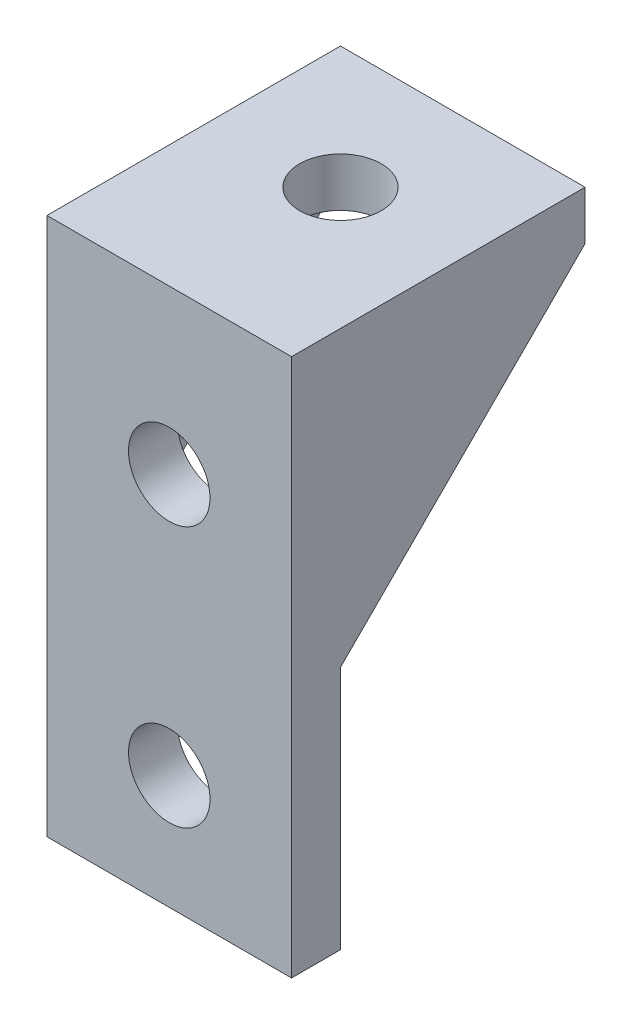
ISO-10303-21;
HEADER;
FILE_DESCRIPTION(('STEP AP214'),'2;1');
FILE_NAME('part.step','',(''),(''),'','','');
FILE_SCHEMA(('AUTOMOTIVE_DESIGN { 1 0 10303 214 1 1 1 1 }'));
ENDSEC;
DATA;
#1=APPLICATION_CONTEXT('core data for automotive mechanical design processes');
#2=APPLICATION_PROTOCOL_DEFINITION('international standard','automotive_design',2000,#1);
#3=PRODUCT_CONTEXT('',#1,'mechanical');
#4=PRODUCT('Part','Part','',(#3));
#5=PRODUCT_RELATED_PRODUCT_CATEGORY('part','',(#4));
#6=PRODUCT_DEFINITION_FORMATION('','',#4);
#7=PRODUCT_DEFINITION_CONTEXT('part definition',#1,'design');
#8=PRODUCT_DEFINITION('design','',#6,#7);
#9=PRODUCT_DEFINITION_SHAPE('','',#8);
#10=(LENGTH_UNIT() NAMED_UNIT(*) SI_UNIT(.MILLI.,.METRE.));
#11=(NAMED_UNIT(*) PLANE_ANGLE_UNIT() SI_UNIT($,.RADIAN.));
#12=(NAMED_UNIT(*) SI_UNIT($,.STERADIAN.) SOLID_ANGLE_UNIT());
#13=UNCERTAINTY_MEASURE_WITH_UNIT(LENGTH_MEASURE(1.E-05),#10,'distance_accuracy_value','');
#14=(GEOMETRIC_REPRESENTATION_CONTEXT(3) GLOBAL_UNCERTAINTY_ASSIGNED_CONTEXT((#13)) GLOBAL_UNIT_ASSIGNED_CONTEXT((#10,
#11,#12)) REPRESENTATION_CONTEXT('',''));
#15=CARTESIAN_POINT('',(0.,0.,0.));
#16=DIRECTION('',(0.,0.,1.));
#17=DIRECTION('',(1.,0.,0.));
#18=AXIS2_PLACEMENT_3D('',#15,#16,#17);
#19=CARTESIAN_POINT('',(0.,15.,0.));
#20=DIRECTION('',(0.,-1.,0.));
#21=DIRECTION('',(0.,0.,-1.));
#22=AXIS2_PLACEMENT_3D('',#19,#20,#21);
#23=PLANE('',#22);
#24=CARTESIAN_POINT('',(0.,15.,-7.5));
#25=DIRECTION('',(0.,1.,0.));
#26=DIRECTION('',(0.,0.,1.));
#27=AXIS2_PLACEMENT_3D('',#24,#25,#26);
#28=CIRCLE('',#27,2.5);
#29=CARTESIAN_POINT('',(0.,15.,-5.));
#30=VERTEX_POINT('',#29);
#31=EDGE_CURVE('E197',#30,#30,#28,.T.);
#32=ORIENTED_EDGE('',*,*,#31,.T.);
#33=EDGE_LOOP('',(#32));
#34=FACE_BOUND('',#33,.T.);
#35=DIRECTION('',(-1.,0.,0.));
#36=VECTOR('',#35,1.);
#37=CARTESIAN_POINT('',(-7.5,15.,0.));
#38=LINE('',#37,#36);
#39=CARTESIAN_POINT('',(5.5,15.,0.));
#40=VERTEX_POINT('',#39);
#41=CARTESIAN_POINT('',(-5.5,15.,0.));
#42=VERTEX_POINT('',#41);
#43=EDGE_CURVE('E94',#40,#42,#38,.T.);
#44=ORIENTED_EDGE('',*,*,#43,.T.);
#45=DIRECTION('',(0.,0.,1.));
#46=VECTOR('',#45,1.);
#47=CARTESIAN_POINT('',(-5.5,15.,-15.));
#48=LINE('',#47,#46);
#49=CARTESIAN_POINT('',(-5.5,15.,-15.));
#50=VERTEX_POINT('',#49);
#51=EDGE_CURVE('E151',#50,#42,#48,.T.);
#52=ORIENTED_EDGE('',*,*,#51,.F.);
#53=DIRECTION('',(-1.,0.,0.));
#54=VECTOR('',#53,1.);
#55=CARTESIAN_POINT('',(-7.5,15.,-15.));
#56=LINE('',#55,#54);
#57=CARTESIAN_POINT('',(5.5,15.,-15.));
#58=VERTEX_POINT('',#57);
#59=EDGE_CURVE('E162',#58,#50,#56,.T.);
#60=ORIENTED_EDGE('',*,*,#59,.F.);
#61=DIRECTION('',(0.,0.,1.));
#62=VECTOR('',#61,1.);
#63=CARTESIAN_POINT('',(5.5,15.,-15.));
#64=LINE('',#63,#62);
#65=EDGE_CURVE('E203',#58,#40,#64,.T.);
#66=ORIENTED_EDGE('',*,*,#65,.T.);
#67=EDGE_LOOP('',(#44,#52,#60,#66));
#68=FACE_BOUND('',#67,.T.);
#69=ADVANCED_FACE('F37',(#34,#68),#23,.T.);
#70=CARTESIAN_POINT('',(0.,0.,0.));
#71=DIRECTION('',(0.,0.,-1.));
#72=DIRECTION('',(-1.,0.,0.));
#73=AXIS2_PLACEMENT_3D('',#70,#71,#72);
#74=PLANE('',#73);
#75=CARTESIAN_POINT('',(0.,8.,0.));
#76=DIRECTION('',(0.,0.,1.));
#77=DIRECTION('',(1.,0.,0.));
#78=AXIS2_PLACEMENT_3D('',#75,#76,#77);
#79=CIRCLE('',#78,2.5);
#80=CARTESIAN_POINT('',(2.5,8.,0.));
#81=VERTEX_POINT('',#80);
#82=EDGE_CURVE('E100',#81,#81,#79,.T.);
#83=ORIENTED_EDGE('',*,*,#82,.T.);
#84=EDGE_LOOP('',(#83));
#85=FACE_BOUND('',#84,.T.);
#86=CARTESIAN_POINT('',(0.,-8.,0.));
#87=DIRECTION('',(0.,0.,1.));
#88=DIRECTION('',(1.,0.,0.));
#89=AXIS2_PLACEMENT_3D('',#86,#87,#88);
#90=CIRCLE('',#89,2.5);
#91=CARTESIAN_POINT('',(2.5,-8.,0.));
#92=VERTEX_POINT('',#91);
#93=EDGE_CURVE('E171',#92,#92,#90,.T.);
#94=ORIENTED_EDGE('',*,*,#93,.T.);
#95=EDGE_LOOP('',(#94));
#96=FACE_BOUND('',#95,.T.);
#97=DIRECTION('',(0.,-1.,0.));
#98=VECTOR('',#97,1.);
#99=CARTESIAN_POINT('',(-7.5,-15.,0.));
#100=LINE('',#99,#98);
#101=CARTESIAN_POINT('',(-7.5,1.57859836313889E-13,0.));
#102=VERTEX_POINT('',#101);
#103=CARTESIAN_POINT('',(-7.5,-15.,0.));
#104=VERTEX_POINT('',#103);
#105=EDGE_CURVE('E82',#102,#104,#100,.T.);
#106=ORIENTED_EDGE('',*,*,#105,.F.);
#107=DIRECTION('',(-1.,0.,0.));
#108=VECTOR('',#107,1.);
#109=CARTESIAN_POINT('',(-5.5,1.57859836313889E-13,0.));
#110=LINE('',#109,#108);
#111=CARTESIAN_POINT('',(-5.5,1.57859836313889E-13,0.));
#112=VERTEX_POINT('',#111);
#113=EDGE_CURVE('E117',#112,#102,#110,.T.);
#114=ORIENTED_EDGE('',*,*,#113,.F.);
#115=DIRECTION('',(0.,-1.,0.));
#116=VECTOR('',#115,1.);
#117=CARTESIAN_POINT('',(-5.5,15.,0.));
#118=LINE('',#117,#116);
#119=EDGE_CURVE('E163',#42,#112,#118,.T.);
#120=ORIENTED_EDGE('',*,*,#119,.F.);
#121=ORIENTED_EDGE('',*,*,#43,.F.);
#122=DIRECTION('',(0.,-1.,0.));
#123=VECTOR('',#122,1.);
#124=CARTESIAN_POINT('',(5.5,15.,0.));
#125=LINE('',#124,#123);
#126=CARTESIAN_POINT('',(5.5,1.57859836313889E-13,0.));
#127=VERTEX_POINT('',#126);
#128=EDGE_CURVE('E206',#40,#127,#125,.T.);
#129=ORIENTED_EDGE('',*,*,#128,.T.);
#130=DIRECTION('',(1.,0.,0.));
#131=VECTOR('',#130,1.);
#132=CARTESIAN_POINT('',(5.5,1.57859836313889E-13,0.));
#133=LINE('',#132,#131);
#134=CARTESIAN_POINT('',(7.5,1.57859836313889E-13,0.));
#135=VERTEX_POINT('',#134);
#136=EDGE_CURVE('E93',#127,#135,#133,.T.);
#137=ORIENTED_EDGE('',*,*,#136,.T.);
#138=DIRECTION('',(0.,1.,0.));
#139=VECTOR('',#138,1.);
#140=CARTESIAN_POINT('',(7.5,-15.,0.));
#141=LINE('',#140,#139);
#142=CARTESIAN_POINT('',(7.5,-15.,0.));
#143=VERTEX_POINT('',#142);
#144=EDGE_CURVE('E88',#143,#135,#141,.T.);
#145=ORIENTED_EDGE('',*,*,#144,.F.);
#146=DIRECTION('',(1.,0.,0.));
#147=VECTOR('',#146,1.);
#148=CARTESIAN_POINT('',(-7.5,-15.,0.));
#149=LINE('',#148,#147);
#150=EDGE_CURVE('E73',#104,#143,#149,.T.);
#151=ORIENTED_EDGE('',*,*,#150,.F.);
#152=EDGE_LOOP('',(#106,#114,#120,#121,#129,#137,#145,#151));
#153=FACE_BOUND('',#152,.T.);
#154=ADVANCED_FACE('F91',(#85,#96,#153),#74,.T.);
#155=CARTESIAN_POINT('',(0.,0.,3.));
#156=DIRECTION('',(0.,0.,-1.));
#157=DIRECTION('',(-1.,0.,0.));
#158=AXIS2_PLACEMENT_3D('',#155,#156,#157);
#159=PLANE('',#158);
#160=DIRECTION('',(0.,1.,0.));
#161=VECTOR('',#160,1.);
#162=CARTESIAN_POINT('',(7.5,-15.,3.));
#163=LINE('',#162,#161);
#164=CARTESIAN_POINT('',(7.5,-15.,3.));
#165=VERTEX_POINT('',#164);
#166=CARTESIAN_POINT('',(7.5,18.,3.));
#167=VERTEX_POINT('',#166);
#168=EDGE_CURVE('E81',#165,#167,#163,.T.);
#169=ORIENTED_EDGE('',*,*,#168,.T.);
#170=DIRECTION('',(1.,0.,0.));
#171=VECTOR('',#170,1.);
#172=CARTESIAN_POINT('',(-7.5,18.,3.));
#173=LINE('',#172,#171);
#174=CARTESIAN_POINT('',(-7.5,18.,3.));
#175=VERTEX_POINT('',#174);
#176=EDGE_CURVE('E190',#175,#167,#173,.T.);
#177=ORIENTED_EDGE('',*,*,#176,.F.);
#178=DIRECTION('',(0.,-1.,0.));
#179=VECTOR('',#178,1.);
#180=CARTESIAN_POINT('',(-7.5,-15.,3.));
#181=LINE('',#180,#179);
#182=CARTESIAN_POINT('',(-7.5,-15.,3.));
#183=VERTEX_POINT('',#182);
#184=EDGE_CURVE('E185',#175,#183,#181,.T.);
#185=ORIENTED_EDGE('',*,*,#184,.T.);
#186=DIRECTION('',(1.,0.,0.));
#187=VECTOR('',#186,1.);
#188=CARTESIAN_POINT('',(-7.5,-15.,3.));
#189=LINE('',#188,#187);
#190=EDGE_CURVE('E61',#183,#165,#189,.T.);
#191=ORIENTED_EDGE('',*,*,#190,.T.);
#192=EDGE_LOOP('',(#169,#177,#185,#191));
#193=FACE_BOUND('',#192,.T.);
#194=CARTESIAN_POINT('',(0.,8.,3.));
#195=DIRECTION('',(0.,0.,1.));
#196=DIRECTION('',(1.,0.,0.));
#197=AXIS2_PLACEMENT_3D('',#194,#195,#196);
#198=CIRCLE('',#197,2.5);
#199=CARTESIAN_POINT('',(2.5,8.,3.));
#200=VERTEX_POINT('',#199);
#201=EDGE_CURVE('E95',#200,#200,#198,.T.);
#202=ORIENTED_EDGE('',*,*,#201,.F.);
#203=EDGE_LOOP('',(#202));
#204=FACE_BOUND('',#203,.T.);
#205=CARTESIAN_POINT('',(0.,-8.,3.));
#206=DIRECTION('',(0.,0.,1.));
#207=DIRECTION('',(1.,0.,0.));
#208=AXIS2_PLACEMENT_3D('',#205,#206,#207);
#209=CIRCLE('',#208,2.5);
#210=CARTESIAN_POINT('',(2.5,-8.,3.));
#211=VERTEX_POINT('',#210);
#212=EDGE_CURVE('E178',#211,#211,#209,.T.);
#213=ORIENTED_EDGE('',*,*,#212,.F.);
#214=EDGE_LOOP('',(#213));
#215=FACE_BOUND('',#214,.T.);
#216=ADVANCED_FACE('F187',(#193,#204,#215),#159,.F.);
#217=CARTESIAN_POINT('',(7.5,-15.,3.));
#218=DIRECTION('',(-1.,0.,0.));
#219=DIRECTION('',(0.,0.,1.));
#220=AXIS2_PLACEMENT_3D('',#217,#218,#219);
#221=PLANE('',#220);
#222=ORIENTED_EDGE('',*,*,#144,.T.);
#223=DIRECTION('',(0.,0.707106781186544,-0.707106781186551));
#224=VECTOR('',#223,1.);
#225=CARTESIAN_POINT('',(7.5,15.,-15.));
#226=LINE('',#225,#224);
#227=CARTESIAN_POINT('',(7.5,15.,-15.));
#228=VERTEX_POINT('',#227);
#229=EDGE_CURVE('E201',#135,#228,#226,.T.);
#230=ORIENTED_EDGE('',*,*,#229,.T.);
#231=DIRECTION('',(0.,-1.,0.));
#232=VECTOR('',#231,1.);
#233=CARTESIAN_POINT('',(7.5,18.,-15.));
#234=LINE('',#233,#232);
#235=CARTESIAN_POINT('',(7.5,18.,-15.));
#236=VERTEX_POINT('',#235);
#237=EDGE_CURVE('E167',#236,#228,#234,.T.);
#238=ORIENTED_EDGE('',*,*,#237,.F.);
#239=DIRECTION('',(0.,0.,-1.));
#240=VECTOR('',#239,1.);
#241=CARTESIAN_POINT('',(7.5,18.,3.));
#242=LINE('',#241,#240);
#243=EDGE_CURVE('E173',#167,#236,#242,.T.);
#244=ORIENTED_EDGE('',*,*,#243,.F.);
#245=ORIENTED_EDGE('',*,*,#168,.F.);
#246=DIRECTION('',(0.,0.,-1.));
#247=VECTOR('',#246,1.);
#248=CARTESIAN_POINT('',(7.5,-15.,3.));
#249=LINE('',#248,#247);
#250=EDGE_CURVE('E45',#165,#143,#249,.T.);
#251=ORIENTED_EDGE('',*,*,#250,.T.);
#252=EDGE_LOOP('',(#222,#230,#238,#244,#245,#251));
#253=FACE_BOUND('',#252,.T.);
#254=ADVANCED_FACE('F39',(#253),#221,.F.);
#255=CARTESIAN_POINT('',(-7.5,-15.,3.));
#256=DIRECTION('',(1.,0.,0.));
#257=DIRECTION('',(0.,0.,-1.));
#258=AXIS2_PLACEMENT_3D('',#255,#256,#257);
#259=PLANE('',#258);
#260=DIRECTION('',(0.,-1.,0.));
#261=VECTOR('',#260,1.);
#262=CARTESIAN_POINT('',(-7.5,18.,-15.));
#263=LINE('',#262,#261);
#264=CARTESIAN_POINT('',(-7.5,18.,-15.));
#265=VERTEX_POINT('',#264);
#266=CARTESIAN_POINT('',(-7.5,15.,-15.));
#267=VERTEX_POINT('',#266);
#268=EDGE_CURVE('E159',#265,#267,#263,.T.);
#269=ORIENTED_EDGE('',*,*,#268,.T.);
#270=DIRECTION('',(0.,0.707106781186544,-0.707106781186551));
#271=VECTOR('',#270,1.);
#272=CARTESIAN_POINT('',(-7.5,15.,-15.));
#273=LINE('',#272,#271);
#274=EDGE_CURVE('E112',#102,#267,#273,.T.);
#275=ORIENTED_EDGE('',*,*,#274,.F.);
#276=ORIENTED_EDGE('',*,*,#105,.T.);
#277=DIRECTION('',(0.,0.,-1.));
#278=VECTOR('',#277,1.);
#279=CARTESIAN_POINT('',(-7.5,-15.,3.));
#280=LINE('',#279,#278);
#281=EDGE_CURVE('E11',#183,#104,#280,.T.);
#282=ORIENTED_EDGE('',*,*,#281,.F.);
#283=ORIENTED_EDGE('',*,*,#184,.F.);
#284=DIRECTION('',(0.,0.,1.));
#285=VECTOR('',#284,1.);
#286=CARTESIAN_POINT('',(-7.5,18.,3.));
#287=LINE('',#286,#285);
#288=EDGE_CURVE('E166',#265,#175,#287,.T.);
#289=ORIENTED_EDGE('',*,*,#288,.F.);
#290=EDGE_LOOP('',(#269,#275,#276,#282,#283,#289));
#291=FACE_BOUND('',#290,.T.);
#292=ADVANCED_FACE('F108',(#291),#259,.F.);
#293=CARTESIAN_POINT('',(-7.5,-15.,3.));
#294=DIRECTION('',(0.,1.,0.));
#295=DIRECTION('',(0.,0.,1.));
#296=AXIS2_PLACEMENT_3D('',#293,#294,#295);
#297=PLANE('',#296);
#298=ORIENTED_EDGE('',*,*,#150,.T.);
#299=ORIENTED_EDGE('',*,*,#250,.F.);
#300=ORIENTED_EDGE('',*,*,#190,.F.);
#301=ORIENTED_EDGE('',*,*,#281,.T.);
#302=EDGE_LOOP('',(#298,#299,#300,#301));
#303=FACE_BOUND('',#302,.T.);
#304=ADVANCED_FACE('F75',(#303),#297,.F.);
#305=CARTESIAN_POINT('',(0.,8.,3.));
#306=DIRECTION('',(0.,0.,-1.));
#307=DIRECTION('',(-1.,0.,0.));
#308=AXIS2_PLACEMENT_3D('',#305,#306,#307);
#309=CYLINDRICAL_SURFACE('',#308,2.5);
#310=ORIENTED_EDGE('',*,*,#201,.T.);
#311=EDGE_LOOP('',(#310));
#312=FACE_BOUND('',#311,.T.);
#313=ORIENTED_EDGE('',*,*,#82,.F.);
#314=EDGE_LOOP('',(#313));
#315=FACE_BOUND('',#314,.T.);
#316=ADVANCED_FACE('F243',(#312,#315),#309,.F.);
#317=CARTESIAN_POINT('',(0.,-8.,3.));
#318=DIRECTION('',(0.,0.,-1.));
#319=DIRECTION('',(-1.,0.,0.));
#320=AXIS2_PLACEMENT_3D('',#317,#318,#319);
#321=CYLINDRICAL_SURFACE('',#320,2.5);
#322=ORIENTED_EDGE('',*,*,#212,.T.);
#323=EDGE_LOOP('',(#322));
#324=FACE_BOUND('',#323,.T.);
#325=ORIENTED_EDGE('',*,*,#93,.F.);
#326=EDGE_LOOP('',(#325));
#327=FACE_BOUND('',#326,.T.);
#328=ADVANCED_FACE('F240',(#324,#327),#321,.F.);
#329=CARTESIAN_POINT('',(0.,18.,0.));
#330=DIRECTION('',(0.,-1.,0.));
#331=DIRECTION('',(0.,0.,-1.));
#332=AXIS2_PLACEMENT_3D('',#329,#330,#331);
#333=PLANE('',#332);
#334=ORIENTED_EDGE('',*,*,#288,.T.);
#335=ORIENTED_EDGE('',*,*,#176,.T.);
#336=ORIENTED_EDGE('',*,*,#243,.T.);
#337=DIRECTION('',(-1.,0.,0.));
#338=VECTOR('',#337,1.);
#339=CARTESIAN_POINT('',(-7.5,18.,-15.));
#340=LINE('',#339,#338);
#341=EDGE_CURVE('E168',#236,#265,#340,.T.);
#342=ORIENTED_EDGE('',*,*,#341,.T.);
#343=EDGE_LOOP('',(#334,#335,#336,#342));
#344=FACE_BOUND('',#343,.T.);
#345=CARTESIAN_POINT('',(0.,18.,-7.5));
#346=DIRECTION('',(0.,1.,0.));
#347=DIRECTION('',(0.,0.,1.));
#348=AXIS2_PLACEMENT_3D('',#345,#346,#347);
#349=CIRCLE('',#348,2.5);
#350=CARTESIAN_POINT('',(0.,18.,-5.));
#351=VERTEX_POINT('',#350);
#352=EDGE_CURVE('E212',#351,#351,#349,.T.);
#353=ORIENTED_EDGE('',*,*,#352,.F.);
#354=EDGE_LOOP('',(#353));
#355=FACE_BOUND('',#354,.T.);
#356=ADVANCED_FACE('F193',(#344,#355),#333,.F.);
#357=CARTESIAN_POINT('',(-7.5,18.,-15.));
#358=DIRECTION('',(0.,0.,1.));
#359=DIRECTION('',(1.,0.,0.));
#360=AXIS2_PLACEMENT_3D('',#357,#358,#359);
#361=PLANE('',#360);
#362=EDGE_CURVE('E176',#228,#58,#56,.T.);
#363=ORIENTED_EDGE('',*,*,#362,.T.);
#364=ORIENTED_EDGE('',*,*,#59,.T.);
#365=DIRECTION('',(-1.,0.,0.));
#366=VECTOR('',#365,1.);
#367=CARTESIAN_POINT('',(-5.5,15.,-15.));
#368=LINE('',#367,#366);
#369=EDGE_CURVE('E149',#50,#267,#368,.T.);
#370=ORIENTED_EDGE('',*,*,#369,.T.);
#371=ORIENTED_EDGE('',*,*,#268,.F.);
#372=ORIENTED_EDGE('',*,*,#341,.F.);
#373=ORIENTED_EDGE('',*,*,#237,.T.);
#374=EDGE_LOOP('',(#363,#364,#370,#371,#372,#373));
#375=FACE_BOUND('',#374,.T.);
#376=ADVANCED_FACE('F157',(#375),#361,.F.);
#377=CARTESIAN_POINT('',(0.,18.,-7.5));
#378=DIRECTION('',(0.,-1.,0.));
#379=DIRECTION('',(0.,0.,-1.));
#380=AXIS2_PLACEMENT_3D('',#377,#378,#379);
#381=CYLINDRICAL_SURFACE('',#380,2.5);
#382=ORIENTED_EDGE('',*,*,#352,.T.);
#383=EDGE_LOOP('',(#382));
#384=FACE_BOUND('',#383,.T.);
#385=ORIENTED_EDGE('',*,*,#31,.F.);
#386=EDGE_LOOP('',(#385));
#387=FACE_BOUND('',#386,.T.);
#388=ADVANCED_FACE('F221',(#384,#387),#381,.F.);
#389=CARTESIAN_POINT('',(5.5,15.,-15.));
#390=DIRECTION('',(0.,-0.707106781186551,-0.707106781186544));
#391=DIRECTION('',(0.,0.707106781186544,-0.707106781186551));
#392=AXIS2_PLACEMENT_3D('',#389,#390,#391);
#393=PLANE('',#392);
#394=ORIENTED_EDGE('',*,*,#229,.F.);
#395=ORIENTED_EDGE('',*,*,#136,.F.);
#396=DIRECTION('',(0.,0.707106781186544,-0.707106781186551));
#397=VECTOR('',#396,1.);
#398=CARTESIAN_POINT('',(5.5,15.,-15.));
#399=LINE('',#398,#397);
#400=EDGE_CURVE('E52',#127,#58,#399,.T.);
#401=ORIENTED_EDGE('',*,*,#400,.T.);
#402=ORIENTED_EDGE('',*,*,#362,.F.);
#403=EDGE_LOOP('',(#394,#395,#401,#402));
#404=FACE_BOUND('',#403,.T.);
#405=ADVANCED_FACE('F202',(#404),#393,.T.);
#406=CARTESIAN_POINT('',(5.5,0.,0.));
#407=DIRECTION('',(1.,0.,0.));
#408=DIRECTION('',(0.,0.,-1.));
#409=AXIS2_PLACEMENT_3D('',#406,#407,#408);
#410=PLANE('',#409);
#411=ORIENTED_EDGE('',*,*,#65,.F.);
#412=ORIENTED_EDGE('',*,*,#400,.F.);
#413=ORIENTED_EDGE('',*,*,#128,.F.);
#414=EDGE_LOOP('',(#411,#412,#413));
#415=FACE_BOUND('',#414,.T.);
#416=ADVANCED_FACE('F228',(#415),#410,.F.);
#417=CARTESIAN_POINT('',(-5.5,15.,-15.));
#418=DIRECTION('',(0.,0.707106781186551,0.707106781186544));
#419=DIRECTION('',(0.,-0.707106781186544,0.707106781186551));
#420=AXIS2_PLACEMENT_3D('',#417,#418,#419);
#421=PLANE('',#420);
#422=ORIENTED_EDGE('',*,*,#274,.T.);
#423=ORIENTED_EDGE('',*,*,#369,.F.);
#424=DIRECTION('',(0.,0.707106781186544,-0.707106781186551));
#425=VECTOR('',#424,1.);
#426=CARTESIAN_POINT('',(-5.5,15.,-15.));
#427=LINE('',#426,#425);
#428=EDGE_CURVE('E315',#112,#50,#427,.T.);
#429=ORIENTED_EDGE('',*,*,#428,.F.);
#430=ORIENTED_EDGE('',*,*,#113,.T.);
#431=EDGE_LOOP('',(#422,#423,#429,#430));
#432=FACE_BOUND('',#431,.T.);
#433=ADVANCED_FACE('F148',(#432),#421,.F.);
#434=CARTESIAN_POINT('',(-5.5,0.,0.));
#435=DIRECTION('',(-1.,0.,0.));
#436=DIRECTION('',(0.,0.,-1.));
#437=AXIS2_PLACEMENT_3D('',#434,#435,#436);
#438=PLANE('',#437);
#439=ORIENTED_EDGE('',*,*,#51,.T.);
#440=ORIENTED_EDGE('',*,*,#119,.T.);
#441=ORIENTED_EDGE('',*,*,#428,.T.);
#442=EDGE_LOOP('',(#439,#440,#441));
#443=FACE_BOUND('',#442,.T.);
#444=ADVANCED_FACE('F295',(#443),#438,.F.);
#445=CLOSED_SHELL('',(#69,#154,#216,#254,#292,#304,#316,#328,#356,#376,#388,#405,#416,#433,#444));
#446=MANIFOLD_SOLID_BREP('B2',#445);
#447=ADVANCED_BREP_SHAPE_REPRESENTATION('',(#18,#446),#14);
#448=SHAPE_DEFINITION_REPRESENTATION(#9,#447);
ENDSEC;
END-ISO-10303-21;
